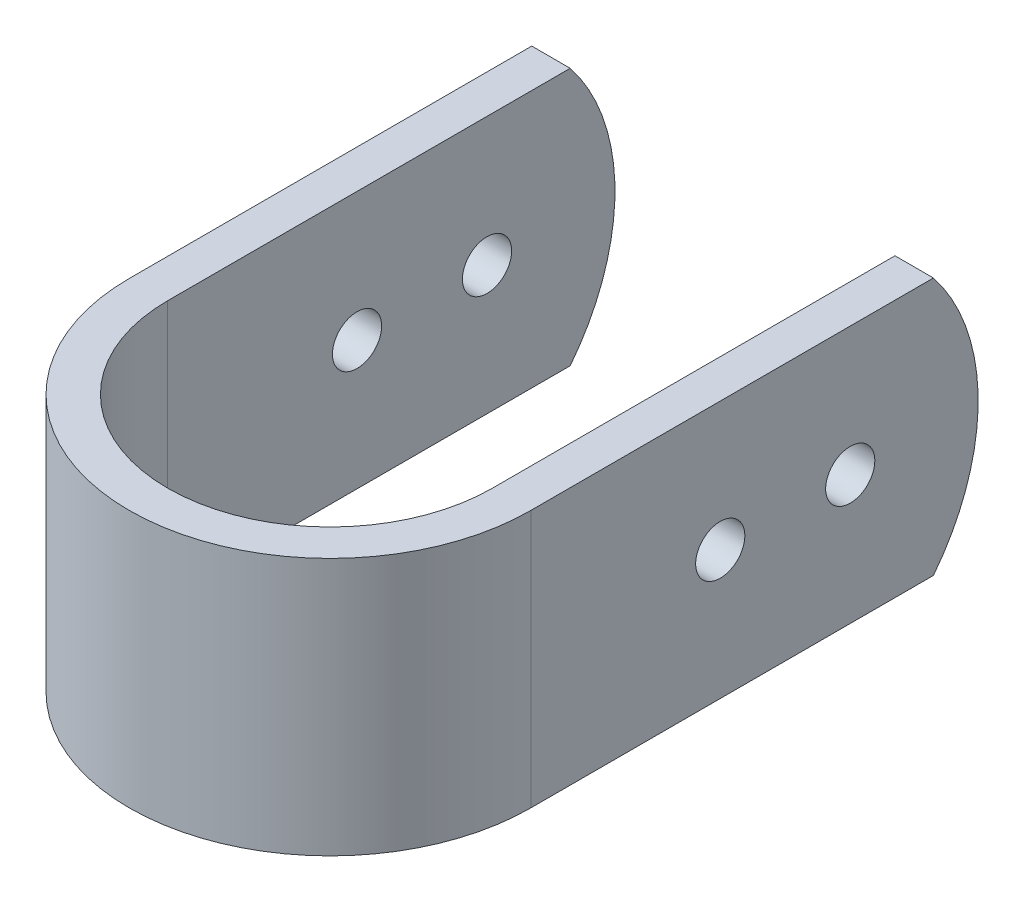
ISO-10303-21;
HEADER;
FILE_DESCRIPTION(('STEP AP214'),'2;1');
FILE_NAME('part.step','',(''),(''),'','','');
FILE_SCHEMA(('AUTOMOTIVE_DESIGN { 1 0 10303 214 1 1 1 1 }'));
ENDSEC;
DATA;
#1=APPLICATION_CONTEXT('core data for automotive mechanical design processes');
#2=APPLICATION_PROTOCOL_DEFINITION('international standard','automotive_design',2000,#1);
#3=PRODUCT_CONTEXT('',#1,'mechanical');
#4=PRODUCT('Part','Part','',(#3));
#5=PRODUCT_RELATED_PRODUCT_CATEGORY('part','',(#4));
#6=PRODUCT_DEFINITION_FORMATION('','',#4);
#7=PRODUCT_DEFINITION_CONTEXT('part definition',#1,'design');
#8=PRODUCT_DEFINITION('design','',#6,#7);
#9=PRODUCT_DEFINITION_SHAPE('','',#8);
#10=(LENGTH_UNIT() NAMED_UNIT(*) SI_UNIT(.MILLI.,.METRE.));
#11=(NAMED_UNIT(*) PLANE_ANGLE_UNIT() SI_UNIT($,.RADIAN.));
#12=(NAMED_UNIT(*) SI_UNIT($,.STERADIAN.) SOLID_ANGLE_UNIT());
#13=UNCERTAINTY_MEASURE_WITH_UNIT(LENGTH_MEASURE(1.E-05),#10,'distance_accuracy_value','');
#14=(GEOMETRIC_REPRESENTATION_CONTEXT(3) GLOBAL_UNCERTAINTY_ASSIGNED_CONTEXT((#13)) GLOBAL_UNIT_ASSIGNED_CONTEXT((#10,
#11,#12)) REPRESENTATION_CONTEXT('',''));
#15=CARTESIAN_POINT('',(0.,0.,0.));
#16=DIRECTION('',(0.,0.,1.));
#17=DIRECTION('',(1.,0.,0.));
#18=AXIS2_PLACEMENT_3D('',#15,#16,#17);
#19=CARTESIAN_POINT('',(22.45,28.8,-50.));
#20=DIRECTION('',(-1.,0.,0.));
#21=DIRECTION('',(0.,0.,1.));
#22=AXIS2_PLACEMENT_3D('',#19,#20,#21);
#23=PLANE('',#22);
#24=CARTESIAN_POINT('',(22.45,14.4,-21.17));
#25=DIRECTION('',(1.,0.,0.));
#26=DIRECTION('',(0.,0.,-1.));
#27=AXIS2_PLACEMENT_3D('',#24,#25,#26);
#28=CIRCLE('',#27,2.74999999999999);
#29=CARTESIAN_POINT('',(22.45,14.4,-23.92));
#30=VERTEX_POINT('',#29);
#31=EDGE_CURVE('E198',#30,#30,#28,.T.);
#32=ORIENTED_EDGE('',*,*,#31,.F.);
#33=EDGE_LOOP('',(#32));
#34=FACE_BOUND('',#33,.T.);
#35=CARTESIAN_POINT('',(22.45,14.4,-35.7));
#36=DIRECTION('',(1.,0.,0.));
#37=DIRECTION('',(0.,0.,-1.));
#38=AXIS2_PLACEMENT_3D('',#35,#36,#37);
#39=CIRCLE('',#38,2.74999999999999);
#40=CARTESIAN_POINT('',(22.45,14.4,-38.45));
#41=VERTEX_POINT('',#40);
#42=EDGE_CURVE('E218',#41,#41,#39,.T.);
#43=ORIENTED_EDGE('',*,*,#42,.F.);
#44=EDGE_LOOP('',(#43));
#45=FACE_BOUND('',#44,.T.);
#46=CARTESIAN_POINT('',(22.45,14.4,-26.764));
#47=DIRECTION('',(1.,0.,0.));
#48=DIRECTION('',(0.,0.,-1.));
#49=AXIS2_PLACEMENT_3D('',#46,#47,#48);
#50=CIRCLE('',#49,23.236);
#51=CARTESIAN_POINT('',(22.45,28.8,-45.));
#52=VERTEX_POINT('',#51);
#53=CARTESIAN_POINT('',(22.45,0.,-45.));
#54=VERTEX_POINT('',#53);
#55=EDGE_CURVE('E54',#52,#54,#50,.F.);
#56=ORIENTED_EDGE('',*,*,#55,.F.);
#57=DIRECTION('',(0.,0.,-1.));
#58=VECTOR('',#57,1.);
#59=CARTESIAN_POINT('',(22.45,28.8,-50.));
#60=LINE('',#59,#58);
#61=CARTESIAN_POINT('',(22.45,28.8,0.));
#62=VERTEX_POINT('',#61);
#63=EDGE_CURVE('E179',#62,#52,#60,.T.);
#64=ORIENTED_EDGE('',*,*,#63,.F.);
#65=DIRECTION('',(0.,-1.,0.));
#66=VECTOR('',#65,1.);
#67=CARTESIAN_POINT('',(22.45,28.8,0.));
#68=LINE('',#67,#66);
#69=CARTESIAN_POINT('',(22.45,0.,0.));
#70=VERTEX_POINT('',#69);
#71=EDGE_CURVE('E166',#62,#70,#68,.T.);
#72=ORIENTED_EDGE('',*,*,#71,.T.);
#73=DIRECTION('',(0.,0.,-1.));
#74=VECTOR('',#73,1.);
#75=CARTESIAN_POINT('',(22.45,0.,-50.));
#76=LINE('',#75,#74);
#77=EDGE_CURVE('E140',#70,#54,#76,.T.);
#78=ORIENTED_EDGE('',*,*,#77,.T.);
#79=EDGE_LOOP('',(#56,#64,#72,#78));
#80=FACE_BOUND('',#79,.T.);
#81=ADVANCED_FACE('F39',(#34,#45,#80),#23,.F.);
#82=CARTESIAN_POINT('',(18.15,28.8,0.));
#83=DIRECTION('',(1.,0.,0.));
#84=DIRECTION('',(0.,0.,-1.));
#85=AXIS2_PLACEMENT_3D('',#82,#83,#84);
#86=PLANE('',#85);
#87=CARTESIAN_POINT('',(18.15,14.4,-21.17));
#88=DIRECTION('',(1.,0.,0.));
#89=DIRECTION('',(0.,0.,-1.));
#90=AXIS2_PLACEMENT_3D('',#87,#88,#89);
#91=CIRCLE('',#90,2.74999999999999);
#92=CARTESIAN_POINT('',(18.15,14.4,-23.92));
#93=VERTEX_POINT('',#92);
#94=EDGE_CURVE('E210',#93,#93,#91,.T.);
#95=ORIENTED_EDGE('',*,*,#94,.T.);
#96=EDGE_LOOP('',(#95));
#97=FACE_BOUND('',#96,.T.);
#98=CARTESIAN_POINT('',(18.15,14.4,-35.7));
#99=DIRECTION('',(1.,0.,0.));
#100=DIRECTION('',(0.,0.,-1.));
#101=AXIS2_PLACEMENT_3D('',#98,#99,#100);
#102=CIRCLE('',#101,2.74999999999999);
#103=CARTESIAN_POINT('',(18.15,14.4,-38.45));
#104=VERTEX_POINT('',#103);
#105=EDGE_CURVE('E226',#104,#104,#102,.T.);
#106=ORIENTED_EDGE('',*,*,#105,.T.);
#107=EDGE_LOOP('',(#106));
#108=FACE_BOUND('',#107,.T.);
#109=DIRECTION('',(0.,0.,1.));
#110=VECTOR('',#109,1.);
#111=CARTESIAN_POINT('',(18.15,28.8,0.));
#112=LINE('',#111,#110);
#113=CARTESIAN_POINT('',(18.15,28.8,-45.));
#114=VERTEX_POINT('',#113);
#115=CARTESIAN_POINT('',(18.15,28.8,0.));
#116=VERTEX_POINT('',#115);
#117=EDGE_CURVE('E194',#114,#116,#112,.T.);
#118=ORIENTED_EDGE('',*,*,#117,.F.);
#119=CARTESIAN_POINT('',(18.15,14.4,-26.764));
#120=DIRECTION('',(1.,0.,0.));
#121=DIRECTION('',(0.,0.,-1.));
#122=AXIS2_PLACEMENT_3D('',#119,#120,#121);
#123=CIRCLE('',#122,23.236);
#124=CARTESIAN_POINT('',(18.15,0.,-45.));
#125=VERTEX_POINT('',#124);
#126=EDGE_CURVE('E195',#114,#125,#123,.F.);
#127=ORIENTED_EDGE('',*,*,#126,.T.);
#128=DIRECTION('',(0.,0.,1.));
#129=VECTOR('',#128,1.);
#130=CARTESIAN_POINT('',(18.15,0.,0.));
#131=LINE('',#130,#129);
#132=CARTESIAN_POINT('',(18.15,0.,0.));
#133=VERTEX_POINT('',#132);
#134=EDGE_CURVE('E145',#125,#133,#131,.T.);
#135=ORIENTED_EDGE('',*,*,#134,.T.);
#136=DIRECTION('',(0.,-1.,0.));
#137=VECTOR('',#136,1.);
#138=CARTESIAN_POINT('',(18.15,28.8,0.));
#139=LINE('',#138,#137);
#140=EDGE_CURVE('E162',#116,#133,#139,.T.);
#141=ORIENTED_EDGE('',*,*,#140,.F.);
#142=EDGE_LOOP('',(#118,#127,#135,#141));
#143=FACE_BOUND('',#142,.T.);
#144=ADVANCED_FACE('F193',(#97,#108,#143),#86,.F.);
#145=CARTESIAN_POINT('',(-18.15,28.8,-50.));
#146=DIRECTION('',(-1.,0.,0.));
#147=DIRECTION('',(0.,0.,1.));
#148=AXIS2_PLACEMENT_3D('',#145,#146,#147);
#149=PLANE('',#148);
#150=CARTESIAN_POINT('',(-18.15,14.4,-21.17));
#151=DIRECTION('',(-1.,0.,0.));
#152=DIRECTION('',(0.,0.,1.));
#153=AXIS2_PLACEMENT_3D('',#150,#151,#152);
#154=CIRCLE('',#153,2.74999999999999);
#155=CARTESIAN_POINT('',(-18.15,14.4,-18.42));
#156=VERTEX_POINT('',#155);
#157=EDGE_CURVE('E214',#156,#156,#154,.T.);
#158=ORIENTED_EDGE('',*,*,#157,.T.);
#159=EDGE_LOOP('',(#158));
#160=FACE_BOUND('',#159,.T.);
#161=CARTESIAN_POINT('',(-18.15,14.4,-35.7));
#162=DIRECTION('',(-1.,0.,0.));
#163=DIRECTION('',(0.,0.,1.));
#164=AXIS2_PLACEMENT_3D('',#161,#162,#163);
#165=CIRCLE('',#164,2.74999999999999);
#166=CARTESIAN_POINT('',(-18.15,14.4,-32.95));
#167=VERTEX_POINT('',#166);
#168=EDGE_CURVE('E141',#167,#167,#165,.T.);
#169=ORIENTED_EDGE('',*,*,#168,.T.);
#170=EDGE_LOOP('',(#169));
#171=FACE_BOUND('',#170,.T.);
#172=CARTESIAN_POINT('',(-18.15,14.4,-26.764));
#173=DIRECTION('',(-1.,0.,0.));
#174=DIRECTION('',(0.,0.,1.));
#175=AXIS2_PLACEMENT_3D('',#172,#173,#174);
#176=CIRCLE('',#175,23.236);
#177=CARTESIAN_POINT('',(-18.15,0.,-45.));
#178=VERTEX_POINT('',#177);
#179=CARTESIAN_POINT('',(-18.15,28.8,-45.));
#180=VERTEX_POINT('',#179);
#181=EDGE_CURVE('E62',#178,#180,#176,.F.);
#182=ORIENTED_EDGE('',*,*,#181,.T.);
#183=DIRECTION('',(0.,0.,-1.));
#184=VECTOR('',#183,1.);
#185=CARTESIAN_POINT('',(-18.15,28.8,-50.));
#186=LINE('',#185,#184);
#187=CARTESIAN_POINT('',(-18.15,28.8,0.));
#188=VERTEX_POINT('',#187);
#189=EDGE_CURVE('E119',#188,#180,#186,.T.);
#190=ORIENTED_EDGE('',*,*,#189,.F.);
#191=DIRECTION('',(0.,-1.,0.));
#192=VECTOR('',#191,1.);
#193=CARTESIAN_POINT('',(-18.15,28.8,0.));
#194=LINE('',#193,#192);
#195=CARTESIAN_POINT('',(-18.15,0.,0.));
#196=VERTEX_POINT('',#195);
#197=EDGE_CURVE('E130',#188,#196,#194,.T.);
#198=ORIENTED_EDGE('',*,*,#197,.T.);
#199=DIRECTION('',(0.,0.,-1.));
#200=VECTOR('',#199,1.);
#201=CARTESIAN_POINT('',(-18.15,0.,-50.));
#202=LINE('',#201,#200);
#203=EDGE_CURVE('E151',#196,#178,#202,.T.);
#204=ORIENTED_EDGE('',*,*,#203,.T.);
#205=EDGE_LOOP('',(#182,#190,#198,#204));
#206=FACE_BOUND('',#205,.T.);
#207=ADVANCED_FACE('F185',(#160,#171,#206),#149,.F.);
#208=CARTESIAN_POINT('',(-22.45,28.8,0.));
#209=DIRECTION('',(1.,0.,0.));
#210=DIRECTION('',(0.,0.,-1.));
#211=AXIS2_PLACEMENT_3D('',#208,#209,#210);
#212=PLANE('',#211);
#213=CARTESIAN_POINT('',(-22.45,14.4,-21.17));
#214=DIRECTION('',(1.,0.,0.));
#215=DIRECTION('',(0.,0.,-1.));
#216=AXIS2_PLACEMENT_3D('',#213,#214,#215);
#217=CIRCLE('',#216,2.74999999999999);
#218=CARTESIAN_POINT('',(-22.45,14.4,-23.92));
#219=VERTEX_POINT('',#218);
#220=EDGE_CURVE('E203',#219,#219,#217,.T.);
#221=ORIENTED_EDGE('',*,*,#220,.T.);
#222=EDGE_LOOP('',(#221));
#223=FACE_BOUND('',#222,.T.);
#224=CARTESIAN_POINT('',(-22.45,14.4,-35.7));
#225=DIRECTION('',(1.,0.,0.));
#226=DIRECTION('',(0.,0.,-1.));
#227=AXIS2_PLACEMENT_3D('',#224,#225,#226);
#228=CIRCLE('',#227,2.74999999999999);
#229=CARTESIAN_POINT('',(-22.45,14.4,-38.45));
#230=VERTEX_POINT('',#229);
#231=EDGE_CURVE('E222',#230,#230,#228,.T.);
#232=ORIENTED_EDGE('',*,*,#231,.T.);
#233=EDGE_LOOP('',(#232));
#234=FACE_BOUND('',#233,.T.);
#235=DIRECTION('',(0.,0.,1.));
#236=VECTOR('',#235,1.);
#237=CARTESIAN_POINT('',(-22.45,28.8,0.));
#238=LINE('',#237,#236);
#239=CARTESIAN_POINT('',(-22.45,28.8,-45.));
#240=VERTEX_POINT('',#239);
#241=CARTESIAN_POINT('',(-22.45,28.8,0.));
#242=VERTEX_POINT('',#241);
#243=EDGE_CURVE('E116',#240,#242,#238,.T.);
#244=ORIENTED_EDGE('',*,*,#243,.F.);
#245=CARTESIAN_POINT('',(-22.45,14.4,-26.764));
#246=DIRECTION('',(1.,0.,0.));
#247=DIRECTION('',(0.,0.,-1.));
#248=AXIS2_PLACEMENT_3D('',#245,#246,#247);
#249=CIRCLE('',#248,23.236);
#250=CARTESIAN_POINT('',(-22.45,0.,-45.));
#251=VERTEX_POINT('',#250);
#252=EDGE_CURVE('E102',#240,#251,#249,.F.);
#253=ORIENTED_EDGE('',*,*,#252,.T.);
#254=DIRECTION('',(0.,0.,1.));
#255=VECTOR('',#254,1.);
#256=CARTESIAN_POINT('',(-22.45,0.,0.));
#257=LINE('',#256,#255);
#258=CARTESIAN_POINT('',(-22.45,0.,0.));
#259=VERTEX_POINT('',#258);
#260=EDGE_CURVE('E155',#251,#259,#257,.T.);
#261=ORIENTED_EDGE('',*,*,#260,.T.);
#262=DIRECTION('',(0.,-1.,0.));
#263=VECTOR('',#262,1.);
#264=CARTESIAN_POINT('',(-22.45,28.8,0.));
#265=LINE('',#264,#263);
#266=EDGE_CURVE('E124',#242,#259,#265,.T.);
#267=ORIENTED_EDGE('',*,*,#266,.F.);
#268=EDGE_LOOP('',(#244,#253,#261,#267));
#269=FACE_BOUND('',#268,.T.);
#270=ADVANCED_FACE('F122',(#223,#234,#269),#212,.F.);
#271=CARTESIAN_POINT('',(0.,28.8,0.));
#272=DIRECTION('',(0.,-1.,0.));
#273=DIRECTION('',(0.,0.,-1.));
#274=AXIS2_PLACEMENT_3D('',#271,#272,#273);
#275=CYLINDRICAL_SURFACE('',#274,22.45);
#276=CARTESIAN_POINT('',(0.,0.,0.));
#277=DIRECTION('',(0.,1.,0.));
#278=DIRECTION('',(0.,0.,1.));
#279=AXIS2_PLACEMENT_3D('',#276,#277,#278);
#280=CIRCLE('',#279,22.45);
#281=EDGE_CURVE('E136',#259,#70,#280,.T.);
#282=ORIENTED_EDGE('',*,*,#281,.T.);
#283=ORIENTED_EDGE('',*,*,#71,.F.);
#284=CARTESIAN_POINT('',(0.,28.8,0.));
#285=DIRECTION('',(0.,1.,0.));
#286=DIRECTION('',(0.,0.,1.));
#287=AXIS2_PLACEMENT_3D('',#284,#285,#286);
#288=CIRCLE('',#287,22.45);
#289=EDGE_CURVE('E157',#242,#62,#288,.T.);
#290=ORIENTED_EDGE('',*,*,#289,.F.);
#291=ORIENTED_EDGE('',*,*,#266,.T.);
#292=EDGE_LOOP('',(#282,#283,#290,#291));
#293=FACE_BOUND('',#292,.T.);
#294=ADVANCED_FACE('F41',(#293),#275,.T.);
#295=CARTESIAN_POINT('',(0.,28.8,0.));
#296=DIRECTION('',(0.,-1.,0.));
#297=DIRECTION('',(0.,0.,-1.));
#298=AXIS2_PLACEMENT_3D('',#295,#296,#297);
#299=CYLINDRICAL_SURFACE('',#298,18.15);
#300=CARTESIAN_POINT('',(0.,0.,0.));
#301=DIRECTION('',(0.,-1.,0.));
#302=DIRECTION('',(0.,0.,1.));
#303=AXIS2_PLACEMENT_3D('',#300,#301,#302);
#304=CIRCLE('',#303,18.15);
#305=EDGE_CURVE('E148',#133,#196,#304,.T.);
#306=ORIENTED_EDGE('',*,*,#305,.T.);
#307=ORIENTED_EDGE('',*,*,#197,.F.);
#308=CARTESIAN_POINT('',(0.,28.8,0.));
#309=DIRECTION('',(0.,-1.,0.));
#310=DIRECTION('',(0.,0.,1.));
#311=AXIS2_PLACEMENT_3D('',#308,#309,#310);
#312=CIRCLE('',#311,18.15);
#313=EDGE_CURVE('E132',#116,#188,#312,.T.);
#314=ORIENTED_EDGE('',*,*,#313,.F.);
#315=ORIENTED_EDGE('',*,*,#140,.T.);
#316=EDGE_LOOP('',(#306,#307,#314,#315));
#317=FACE_BOUND('',#316,.T.);
#318=ADVANCED_FACE('F189',(#317),#299,.F.);
#319=CARTESIAN_POINT('',(0.,28.8,0.));
#320=DIRECTION('',(0.,1.,0.));
#321=DIRECTION('',(0.,0.,1.));
#322=AXIS2_PLACEMENT_3D('',#319,#320,#321);
#323=PLANE('',#322);
#324=DIRECTION('',(1.,0.,0.));
#325=VECTOR('',#324,1.);
#326=CARTESIAN_POINT('',(-22.45,28.8,-45.));
#327=LINE('',#326,#325);
#328=EDGE_CURVE('E105',#240,#180,#327,.T.);
#329=ORIENTED_EDGE('',*,*,#328,.F.);
#330=ORIENTED_EDGE('',*,*,#243,.T.);
#331=ORIENTED_EDGE('',*,*,#289,.T.);
#332=ORIENTED_EDGE('',*,*,#63,.T.);
#333=DIRECTION('',(1.,0.,0.));
#334=VECTOR('',#333,1.);
#335=CARTESIAN_POINT('',(-22.45,28.8,-45.));
#336=LINE('',#335,#334);
#337=EDGE_CURVE('E11',#114,#52,#336,.T.);
#338=ORIENTED_EDGE('',*,*,#337,.F.);
#339=ORIENTED_EDGE('',*,*,#117,.T.);
#340=ORIENTED_EDGE('',*,*,#313,.T.);
#341=ORIENTED_EDGE('',*,*,#189,.T.);
#342=EDGE_LOOP('',(#329,#330,#331,#332,#338,#339,#340,#341));
#343=FACE_BOUND('',#342,.T.);
#344=ADVANCED_FACE('F114',(#343),#323,.T.);
#345=CARTESIAN_POINT('',(0.,0.,0.));
#346=DIRECTION('',(0.,1.,0.));
#347=DIRECTION('',(0.,0.,1.));
#348=AXIS2_PLACEMENT_3D('',#345,#346,#347);
#349=PLANE('',#348);
#350=ORIENTED_EDGE('',*,*,#260,.F.);
#351=DIRECTION('',(1.,0.,0.));
#352=VECTOR('',#351,1.);
#353=CARTESIAN_POINT('',(-22.45,0.,-45.));
#354=LINE('',#353,#352);
#355=EDGE_CURVE('E107',#251,#178,#354,.T.);
#356=ORIENTED_EDGE('',*,*,#355,.T.);
#357=ORIENTED_EDGE('',*,*,#203,.F.);
#358=ORIENTED_EDGE('',*,*,#305,.F.);
#359=ORIENTED_EDGE('',*,*,#134,.F.);
#360=DIRECTION('',(1.,0.,0.));
#361=VECTOR('',#360,1.);
#362=CARTESIAN_POINT('',(-22.45,0.,-45.));
#363=LINE('',#362,#361);
#364=EDGE_CURVE('E48',#125,#54,#363,.T.);
#365=ORIENTED_EDGE('',*,*,#364,.T.);
#366=ORIENTED_EDGE('',*,*,#77,.F.);
#367=ORIENTED_EDGE('',*,*,#281,.F.);
#368=EDGE_LOOP('',(#350,#356,#357,#358,#359,#365,#366,#367));
#369=FACE_BOUND('',#368,.T.);
#370=ADVANCED_FACE('F172',(#369),#349,.F.);
#371=CARTESIAN_POINT('',(22.45,14.4,-35.7));
#372=DIRECTION('',(1.,0.,0.));
#373=DIRECTION('',(0.,0.,-1.));
#374=AXIS2_PLACEMENT_3D('',#371,#372,#373);
#375=CYLINDRICAL_SURFACE('',#374,2.74999999999999);
#376=ORIENTED_EDGE('',*,*,#231,.F.);
#377=EDGE_LOOP('',(#376));
#378=FACE_BOUND('',#377,.T.);
#379=ORIENTED_EDGE('',*,*,#168,.F.);
#380=EDGE_LOOP('',(#379));
#381=FACE_BOUND('',#380,.T.);
#382=ADVANCED_FACE('F270',(#378,#381),#375,.F.);
#383=ORIENTED_EDGE('',*,*,#42,.T.);
#384=EDGE_LOOP('',(#383));
#385=FACE_BOUND('',#384,.T.);
#386=ORIENTED_EDGE('',*,*,#105,.F.);
#387=EDGE_LOOP('',(#386));
#388=FACE_BOUND('',#387,.T.);
#389=ADVANCED_FACE('F274',(#385,#388),#375,.F.);
#390=CARTESIAN_POINT('',(22.45,14.4,-21.17));
#391=DIRECTION('',(1.,0.,0.));
#392=DIRECTION('',(0.,0.,-1.));
#393=AXIS2_PLACEMENT_3D('',#390,#391,#392);
#394=CYLINDRICAL_SURFACE('',#393,2.74999999999999);
#395=ORIENTED_EDGE('',*,*,#31,.T.);
#396=EDGE_LOOP('',(#395));
#397=FACE_BOUND('',#396,.T.);
#398=ORIENTED_EDGE('',*,*,#94,.F.);
#399=EDGE_LOOP('',(#398));
#400=FACE_BOUND('',#399,.T.);
#401=ADVANCED_FACE('F247',(#397,#400),#394,.F.);
#402=ORIENTED_EDGE('',*,*,#220,.F.);
#403=EDGE_LOOP('',(#402));
#404=FACE_BOUND('',#403,.T.);
#405=ORIENTED_EDGE('',*,*,#157,.F.);
#406=EDGE_LOOP('',(#405));
#407=FACE_BOUND('',#406,.T.);
#408=ADVANCED_FACE('F241',(#404,#407),#394,.F.);
#409=CARTESIAN_POINT('',(-22.45,14.4,-26.764));
#410=DIRECTION('',(1.,0.,0.));
#411=DIRECTION('',(0.,0.,-1.));
#412=AXIS2_PLACEMENT_3D('',#409,#410,#411);
#413=CYLINDRICAL_SURFACE('',#412,23.236);
#414=ORIENTED_EDGE('',*,*,#126,.F.);
#415=ORIENTED_EDGE('',*,*,#337,.T.);
#416=ORIENTED_EDGE('',*,*,#55,.T.);
#417=ORIENTED_EDGE('',*,*,#364,.F.);
#418=EDGE_LOOP('',(#414,#415,#416,#417));
#419=FACE_BOUND('',#418,.T.);
#420=ADVANCED_FACE('F239',(#419),#413,.T.);
#421=ORIENTED_EDGE('',*,*,#355,.F.);
#422=ORIENTED_EDGE('',*,*,#252,.F.);
#423=ORIENTED_EDGE('',*,*,#328,.T.);
#424=ORIENTED_EDGE('',*,*,#181,.F.);
#425=EDGE_LOOP('',(#421,#422,#423,#424));
#426=FACE_BOUND('',#425,.T.);
#427=ADVANCED_FACE('F104',(#426),#413,.T.);
#428=CLOSED_SHELL('',(#81,#144,#207,#270,#294,#318,#344,#370,#382,#389,#401,#408,#420,#427));
#429=MANIFOLD_SOLID_BREP('B2',#428);
#430=ADVANCED_BREP_SHAPE_REPRESENTATION('',(#18,#429),#14);
#431=SHAPE_DEFINITION_REPRESENTATION(#9,#430);
ENDSEC;
END-ISO-10303-21;
